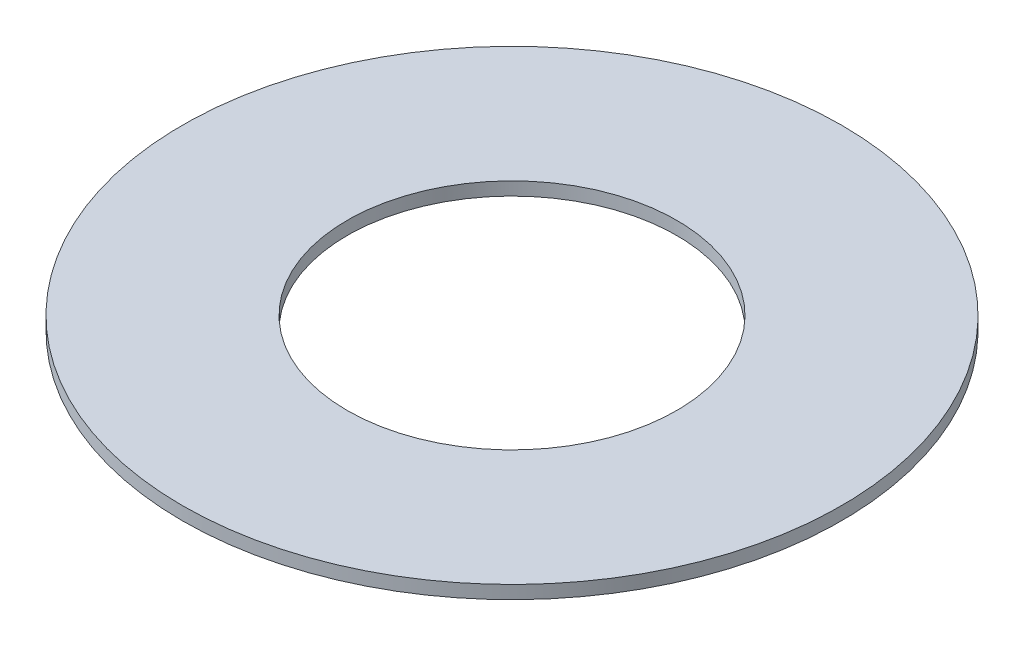
ISO-10303-21;
HEADER;
FILE_DESCRIPTION(('STEP AP214'),'2;1');
FILE_NAME('part.step','',(''),(''),'','','');
FILE_SCHEMA(('AUTOMOTIVE_DESIGN { 1 0 10303 214 1 1 1 1 }'));
ENDSEC;
DATA;
#1=APPLICATION_CONTEXT('core data for automotive mechanical design processes');
#2=APPLICATION_PROTOCOL_DEFINITION('international standard','automotive_design',2000,#1);
#3=PRODUCT_CONTEXT('',#1,'mechanical');
#4=PRODUCT('Part','Part','',(#3));
#5=PRODUCT_RELATED_PRODUCT_CATEGORY('part','',(#4));
#6=PRODUCT_DEFINITION_FORMATION('','',#4);
#7=PRODUCT_DEFINITION_CONTEXT('part definition',#1,'design');
#8=PRODUCT_DEFINITION('design','',#6,#7);
#9=PRODUCT_DEFINITION_SHAPE('','',#8);
#10=(LENGTH_UNIT() NAMED_UNIT(*) SI_UNIT(.MILLI.,.METRE.));
#11=(NAMED_UNIT(*) PLANE_ANGLE_UNIT() SI_UNIT($,.RADIAN.));
#12=(NAMED_UNIT(*) SI_UNIT($,.STERADIAN.) SOLID_ANGLE_UNIT());
#13=UNCERTAINTY_MEASURE_WITH_UNIT(LENGTH_MEASURE(1.E-05),#10,'distance_accuracy_value','');
#14=(GEOMETRIC_REPRESENTATION_CONTEXT(3) GLOBAL_UNCERTAINTY_ASSIGNED_CONTEXT((#13)) GLOBAL_UNIT_ASSIGNED_CONTEXT((#10,
#11,#12)) REPRESENTATION_CONTEXT('',''));
#15=CARTESIAN_POINT('',(0.,0.,0.));
#16=DIRECTION('',(0.,0.,1.));
#17=DIRECTION('',(1.,0.,0.));
#18=AXIS2_PLACEMENT_3D('',#15,#16,#17);
#19=CARTESIAN_POINT('',(0.,0.2,0.));
#20=DIRECTION('',(0.,1.,0.));
#21=DIRECTION('',(0.,0.,1.));
#22=AXIS2_PLACEMENT_3D('',#19,#20,#21);
#23=PLANE('',#22);
#24=CARTESIAN_POINT('',(0.,0.2,0.));
#25=DIRECTION('',(0.,1.,0.));
#26=DIRECTION('',(0.,0.,1.));
#27=AXIS2_PLACEMENT_3D('',#24,#25,#26);
#28=CIRCLE('',#27,5.);
#29=CARTESIAN_POINT('',(0.,0.2,5.));
#30=VERTEX_POINT('',#29);
#31=EDGE_CURVE('E10',#30,#30,#28,.T.);
#32=ORIENTED_EDGE('',*,*,#31,.T.);
#33=EDGE_LOOP('',(#32));
#34=FACE_BOUND('',#33,.T.);
#35=CARTESIAN_POINT('',(0.,0.2,0.));
#36=DIRECTION('',(0.,1.,0.));
#37=DIRECTION('',(0.,0.,1.));
#38=AXIS2_PLACEMENT_3D('',#35,#36,#37);
#39=CIRCLE('',#38,2.5);
#40=CARTESIAN_POINT('',(0.,0.2,2.5));
#41=VERTEX_POINT('',#40);
#42=EDGE_CURVE('E41',#41,#41,#39,.T.);
#43=ORIENTED_EDGE('',*,*,#42,.F.);
#44=EDGE_LOOP('',(#43));
#45=FACE_BOUND('',#44,.T.);
#46=ADVANCED_FACE('F30',(#34,#45),#23,.T.);
#47=CARTESIAN_POINT('',(0.,0.,0.));
#48=DIRECTION('',(0.,1.,0.));
#49=DIRECTION('',(0.,0.,1.));
#50=AXIS2_PLACEMENT_3D('',#47,#48,#49);
#51=PLANE('',#50);
#52=CARTESIAN_POINT('',(0.,0.,0.));
#53=DIRECTION('',(0.,1.,0.));
#54=DIRECTION('',(0.,0.,1.));
#55=AXIS2_PLACEMENT_3D('',#52,#53,#54);
#56=CIRCLE('',#55,5.);
#57=CARTESIAN_POINT('',(0.,0.,5.));
#58=VERTEX_POINT('',#57);
#59=EDGE_CURVE('E34',#58,#58,#56,.T.);
#60=ORIENTED_EDGE('',*,*,#59,.F.);
#61=EDGE_LOOP('',(#60));
#62=FACE_BOUND('',#61,.T.);
#63=CARTESIAN_POINT('',(0.,0.,0.));
#64=DIRECTION('',(0.,1.,0.));
#65=DIRECTION('',(0.,0.,1.));
#66=AXIS2_PLACEMENT_3D('',#63,#64,#65);
#67=CIRCLE('',#66,2.5);
#68=CARTESIAN_POINT('',(0.,0.,2.5));
#69=VERTEX_POINT('',#68);
#70=EDGE_CURVE('E43',#69,#69,#67,.T.);
#71=ORIENTED_EDGE('',*,*,#70,.T.);
#72=EDGE_LOOP('',(#71));
#73=FACE_BOUND('',#72,.T.);
#74=ADVANCED_FACE('F53',(#62,#73),#51,.F.);
#75=CARTESIAN_POINT('',(0.,0.2,0.));
#76=DIRECTION('',(0.,-1.,0.));
#77=DIRECTION('',(0.,0.,-1.));
#78=AXIS2_PLACEMENT_3D('',#75,#76,#77);
#79=CYLINDRICAL_SURFACE('',#78,5.);
#80=ORIENTED_EDGE('',*,*,#31,.F.);
#81=EDGE_LOOP('',(#80));
#82=FACE_BOUND('',#81,.T.);
#83=ORIENTED_EDGE('',*,*,#59,.T.);
#84=EDGE_LOOP('',(#83));
#85=FACE_BOUND('',#84,.T.);
#86=ADVANCED_FACE('F32',(#82,#85),#79,.T.);
#87=CARTESIAN_POINT('',(0.,0.2,0.));
#88=DIRECTION('',(0.,-1.,0.));
#89=DIRECTION('',(0.,0.,-1.));
#90=AXIS2_PLACEMENT_3D('',#87,#88,#89);
#91=CYLINDRICAL_SURFACE('',#90,2.5);
#92=ORIENTED_EDGE('',*,*,#42,.T.);
#93=EDGE_LOOP('',(#92));
#94=FACE_BOUND('',#93,.T.);
#95=ORIENTED_EDGE('',*,*,#70,.F.);
#96=EDGE_LOOP('',(#95));
#97=FACE_BOUND('',#96,.T.);
#98=ADVANCED_FACE('F49',(#94,#97),#91,.F.);
#99=CLOSED_SHELL('',(#46,#74,#86,#98));
#100=MANIFOLD_SOLID_BREP('B2',#99);
#101=ADVANCED_BREP_SHAPE_REPRESENTATION('',(#18,#100),#14);
#102=SHAPE_DEFINITION_REPRESENTATION(#9,#101);
ENDSEC;
END-ISO-10303-21;
